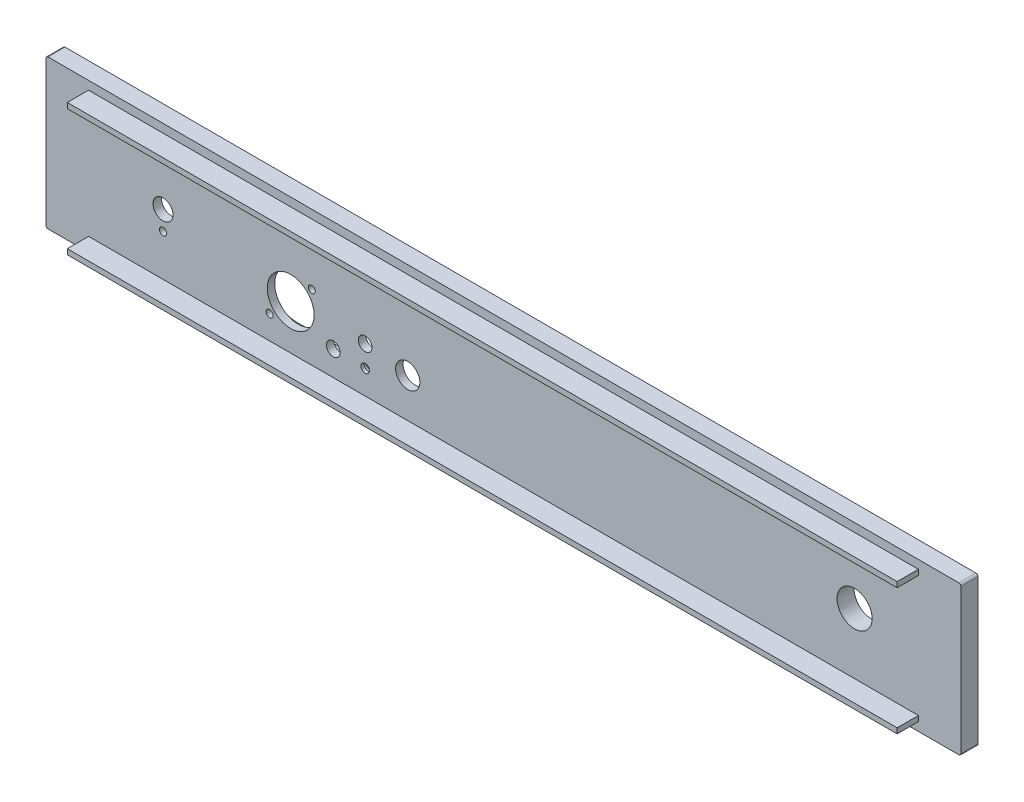
ISO-10303-21;
HEADER;
FILE_DESCRIPTION(('STEP AP214'),'2;1');
FILE_NAME('part.step','',(''),(''),'','','');
FILE_SCHEMA(('AUTOMOTIVE_DESIGN { 1 0 10303 214 1 1 1 1 }'));
ENDSEC;
DATA;
#1=APPLICATION_CONTEXT('core data for automotive mechanical design processes');
#2=APPLICATION_PROTOCOL_DEFINITION('international standard','automotive_design',2000,#1);
#3=PRODUCT_CONTEXT('',#1,'mechanical');
#4=PRODUCT('Part','Part','',(#3));
#5=PRODUCT_RELATED_PRODUCT_CATEGORY('part','',(#4));
#6=PRODUCT_DEFINITION_FORMATION('','',#4);
#7=PRODUCT_DEFINITION_CONTEXT('part definition',#1,'design');
#8=PRODUCT_DEFINITION('design','',#6,#7);
#9=PRODUCT_DEFINITION_SHAPE('','',#8);
#10=(LENGTH_UNIT() NAMED_UNIT(*) SI_UNIT(.MILLI.,.METRE.));
#11=(NAMED_UNIT(*) PLANE_ANGLE_UNIT() SI_UNIT($,.RADIAN.));
#12=(NAMED_UNIT(*) SI_UNIT($,.STERADIAN.) SOLID_ANGLE_UNIT());
#13=UNCERTAINTY_MEASURE_WITH_UNIT(LENGTH_MEASURE(1.E-05),#10,'distance_accuracy_value','');
#14=(GEOMETRIC_REPRESENTATION_CONTEXT(3) GLOBAL_UNCERTAINTY_ASSIGNED_CONTEXT((#13)) GLOBAL_UNIT_ASSIGNED_CONTEXT((#10,
#11,#12)) REPRESENTATION_CONTEXT('',''));
#15=CARTESIAN_POINT('',(0.,0.,0.));
#16=DIRECTION('',(0.,0.,1.));
#17=DIRECTION('',(1.,0.,0.));
#18=AXIS2_PLACEMENT_3D('',#15,#16,#17);
#19=CARTESIAN_POINT('',(-160.,-9.00000000000001,18.));
#20=DIRECTION('',(0.,0.,-1.));
#21=DIRECTION('',(-1.,0.,0.));
#22=AXIS2_PLACEMENT_3D('',#19,#20,#21);
#23=CYLINDRICAL_SURFACE('',#22,1.70000000000001);
#24=CARTESIAN_POINT('',(-160.,-9.00000000000001,8.));
#25=DIRECTION('',(0.,0.,-1.));
#26=DIRECTION('',(-1.,0.,0.));
#27=AXIS2_PLACEMENT_3D('',#24,#25,#26);
#28=CIRCLE('',#27,1.70000000000001);
#29=CARTESIAN_POINT('',(-161.7,-9.00000000000001,8.));
#30=VERTEX_POINT('',#29);
#31=EDGE_CURVE('E251',#30,#30,#28,.T.);
#32=ORIENTED_EDGE('',*,*,#31,.F.);
#33=EDGE_LOOP('',(#32));
#34=FACE_BOUND('',#33,.T.);
#35=CARTESIAN_POINT('',(-160.,-9.00000000000001,4.));
#36=DIRECTION('',(0.,0.,-1.));
#37=DIRECTION('',(-1.,0.,0.));
#38=AXIS2_PLACEMENT_3D('',#35,#36,#37);
#39=CIRCLE('',#38,1.70000000000001);
#40=CARTESIAN_POINT('',(-161.7,-9.00000000000001,4.));
#41=VERTEX_POINT('',#40);
#42=EDGE_CURVE('E404',#41,#41,#39,.F.);
#43=ORIENTED_EDGE('',*,*,#42,.F.);
#44=EDGE_LOOP('',(#43));
#45=FACE_BOUND('',#44,.T.);
#46=ADVANCED_FACE('F44',(#34,#45),#23,.F.);
#47=CARTESIAN_POINT('',(-160.,0.,18.));
#48=DIRECTION('',(0.,0.,-1.));
#49=DIRECTION('',(-1.,0.,0.));
#50=AXIS2_PLACEMENT_3D('',#47,#48,#49);
#51=CYLINDRICAL_SURFACE('',#50,4.70000000000001);
#52=CARTESIAN_POINT('',(-160.,0.,8.));
#53=DIRECTION('',(0.,0.,-1.));
#54=DIRECTION('',(-1.,0.,0.));
#55=AXIS2_PLACEMENT_3D('',#52,#53,#54);
#56=CIRCLE('',#55,4.70000000000001);
#57=CARTESIAN_POINT('',(-164.7,0.,8.));
#58=VERTEX_POINT('',#57);
#59=EDGE_CURVE('E248',#58,#58,#56,.T.);
#60=ORIENTED_EDGE('',*,*,#59,.F.);
#61=EDGE_LOOP('',(#60));
#62=FACE_BOUND('',#61,.T.);
#63=CARTESIAN_POINT('',(-160.,0.,4.));
#64=DIRECTION('',(0.,0.,-1.));
#65=DIRECTION('',(-1.,0.,0.));
#66=AXIS2_PLACEMENT_3D('',#63,#64,#65);
#67=CIRCLE('',#66,4.70000000000001);
#68=CARTESIAN_POINT('',(-164.7,0.,4.));
#69=VERTEX_POINT('',#68);
#70=EDGE_CURVE('E48',#69,#69,#67,.F.);
#71=ORIENTED_EDGE('',*,*,#70,.F.);
#72=EDGE_LOOP('',(#71));
#73=FACE_BOUND('',#72,.T.);
#74=ADVANCED_FACE('F419',(#62,#73),#51,.F.);
#75=CARTESIAN_POINT('',(-64.9999999999999,-17.2,18.));
#76=DIRECTION('',(0.,0.,-1.));
#77=DIRECTION('',(-1.,0.,0.));
#78=AXIS2_PLACEMENT_3D('',#75,#76,#77);
#79=CYLINDRICAL_SURFACE('',#78,2.);
#80=CARTESIAN_POINT('',(-64.9999999999999,-17.2,8.));
#81=DIRECTION('',(0.,0.,-1.));
#82=DIRECTION('',(-1.,0.,0.));
#83=AXIS2_PLACEMENT_3D('',#80,#81,#82);
#84=CIRCLE('',#83,2.);
#85=CARTESIAN_POINT('',(-66.9999999999999,-17.2,8.));
#86=VERTEX_POINT('',#85);
#87=EDGE_CURVE('E245',#86,#86,#84,.T.);
#88=ORIENTED_EDGE('',*,*,#87,.F.);
#89=EDGE_LOOP('',(#88));
#90=FACE_BOUND('',#89,.T.);
#91=CARTESIAN_POINT('',(-64.9999999999999,-17.2,6.5));
#92=DIRECTION('',(0.,0.,-1.));
#93=DIRECTION('',(-1.,0.,0.));
#94=AXIS2_PLACEMENT_3D('',#91,#92,#93);
#95=CIRCLE('',#94,2.);
#96=CARTESIAN_POINT('',(-66.9999999999999,-17.2,6.5));
#97=VERTEX_POINT('',#96);
#98=EDGE_CURVE('E217',#97,#97,#95,.F.);
#99=ORIENTED_EDGE('',*,*,#98,.F.);
#100=EDGE_LOOP('',(#99));
#101=FACE_BOUND('',#100,.T.);
#102=ADVANCED_FACE('F421',(#90,#101),#79,.F.);
#103=CARTESIAN_POINT('',(-90.0999999999999,2.39999999999999,18.));
#104=DIRECTION('',(0.,0.,-1.));
#105=DIRECTION('',(-1.,0.,0.));
#106=AXIS2_PLACEMENT_3D('',#103,#104,#105);
#107=CYLINDRICAL_SURFACE('',#106,1.65000000000002);
#108=CARTESIAN_POINT('',(-90.0999999999999,2.39999999999999,8.));
#109=DIRECTION('',(0.,0.,-1.));
#110=DIRECTION('',(-1.,0.,0.));
#111=AXIS2_PLACEMENT_3D('',#108,#109,#110);
#112=CIRCLE('',#111,1.65000000000002);
#113=CARTESIAN_POINT('',(-91.7499999999999,2.39999999999999,8.));
#114=VERTEX_POINT('',#113);
#115=EDGE_CURVE('E266',#114,#114,#112,.T.);
#116=ORIENTED_EDGE('',*,*,#115,.F.);
#117=EDGE_LOOP('',(#116));
#118=FACE_BOUND('',#117,.T.);
#119=CARTESIAN_POINT('',(-90.0999999999999,2.39999999999999,4.5));
#120=DIRECTION('',(0.,0.,-1.));
#121=DIRECTION('',(-1.,0.,0.));
#122=AXIS2_PLACEMENT_3D('',#119,#120,#121);
#123=CIRCLE('',#122,1.65000000000002);
#124=CARTESIAN_POINT('',(-91.7499999999999,2.39999999999999,4.5));
#125=VERTEX_POINT('',#124);
#126=EDGE_CURVE('E239',#125,#125,#123,.F.);
#127=ORIENTED_EDGE('',*,*,#126,.F.);
#128=EDGE_LOOP('',(#127));
#129=FACE_BOUND('',#128,.T.);
#130=ADVANCED_FACE('F428',(#118,#129),#107,.F.);
#131=CARTESIAN_POINT('',(-99.9999999999999,-7.50000000000001,18.));
#132=DIRECTION('',(0.,0.,-1.));
#133=DIRECTION('',(-1.,0.,0.));
#134=AXIS2_PLACEMENT_3D('',#131,#132,#133);
#135=CYLINDRICAL_SURFACE('',#134,11.);
#136=CARTESIAN_POINT('',(-99.9999999999999,-7.50000000000001,8.));
#137=DIRECTION('',(0.,0.,-1.));
#138=DIRECTION('',(-1.,0.,0.));
#139=AXIS2_PLACEMENT_3D('',#136,#137,#138);
#140=CIRCLE('',#139,11.);
#141=CARTESIAN_POINT('',(-111.,-7.50000000000001,8.));
#142=VERTEX_POINT('',#141);
#143=EDGE_CURVE('E263',#142,#142,#140,.T.);
#144=ORIENTED_EDGE('',*,*,#143,.F.);
#145=EDGE_LOOP('',(#144));
#146=FACE_BOUND('',#145,.T.);
#147=CARTESIAN_POINT('',(-99.9999999999999,-7.50000000000001,4.5));
#148=DIRECTION('',(0.,0.,-1.));
#149=DIRECTION('',(-1.,0.,0.));
#150=AXIS2_PLACEMENT_3D('',#147,#148,#149);
#151=CIRCLE('',#150,11.);
#152=CARTESIAN_POINT('',(-111.,-7.50000000000001,4.5));
#153=VERTEX_POINT('',#152);
#154=EDGE_CURVE('E236',#153,#153,#151,.F.);
#155=ORIENTED_EDGE('',*,*,#154,.F.);
#156=EDGE_LOOP('',(#155));
#157=FACE_BOUND('',#156,.T.);
#158=ADVANCED_FACE('F448',(#146,#157),#135,.F.);
#159=CARTESIAN_POINT('',(-109.9,-17.4,18.));
#160=DIRECTION('',(0.,0.,-1.));
#161=DIRECTION('',(-1.,0.,0.));
#162=AXIS2_PLACEMENT_3D('',#159,#160,#161);
#163=CYLINDRICAL_SURFACE('',#162,1.65000000000002);
#164=CARTESIAN_POINT('',(-109.9,-17.4,8.));
#165=DIRECTION('',(0.,0.,-1.));
#166=DIRECTION('',(-1.,0.,0.));
#167=AXIS2_PLACEMENT_3D('',#164,#165,#166);
#168=CIRCLE('',#167,1.65000000000002);
#169=CARTESIAN_POINT('',(-111.55,-17.4,8.));
#170=VERTEX_POINT('',#169);
#171=EDGE_CURVE('E260',#170,#170,#168,.T.);
#172=ORIENTED_EDGE('',*,*,#171,.F.);
#173=EDGE_LOOP('',(#172));
#174=FACE_BOUND('',#173,.T.);
#175=CARTESIAN_POINT('',(-109.9,-17.4,4.5));
#176=DIRECTION('',(0.,0.,-1.));
#177=DIRECTION('',(-1.,0.,0.));
#178=AXIS2_PLACEMENT_3D('',#175,#176,#177);
#179=CIRCLE('',#178,1.65000000000002);
#180=CARTESIAN_POINT('',(-111.55,-17.4,4.5));
#181=VERTEX_POINT('',#180);
#182=EDGE_CURVE('E233',#181,#181,#179,.F.);
#183=ORIENTED_EDGE('',*,*,#182,.F.);
#184=EDGE_LOOP('',(#183));
#185=FACE_BOUND('',#184,.T.);
#186=ADVANCED_FACE('F444',(#174,#185),#163,.F.);
#187=CARTESIAN_POINT('',(-79.9999999999999,-16.75,18.));
#188=DIRECTION('',(0.,0.,-1.));
#189=DIRECTION('',(-1.,0.,0.));
#190=AXIS2_PLACEMENT_3D('',#187,#188,#189);
#191=CYLINDRICAL_SURFACE('',#190,3.25000000000001);
#192=CARTESIAN_POINT('',(-79.9999999999999,-16.75,8.));
#193=DIRECTION('',(0.,0.,-1.));
#194=DIRECTION('',(-1.,0.,0.));
#195=AXIS2_PLACEMENT_3D('',#192,#193,#194);
#196=CIRCLE('',#195,3.25000000000001);
#197=CARTESIAN_POINT('',(-83.2499999999999,-16.75,8.));
#198=VERTEX_POINT('',#197);
#199=EDGE_CURVE('E257',#198,#198,#196,.T.);
#200=ORIENTED_EDGE('',*,*,#199,.F.);
#201=EDGE_LOOP('',(#200));
#202=FACE_BOUND('',#201,.T.);
#203=CARTESIAN_POINT('',(-79.9999999999999,-16.75,4.5));
#204=DIRECTION('',(0.,0.,-1.));
#205=DIRECTION('',(-1.,0.,0.));
#206=AXIS2_PLACEMENT_3D('',#203,#204,#205);
#207=CIRCLE('',#206,3.25000000000001);
#208=CARTESIAN_POINT('',(-83.2499999999999,-16.75,4.5));
#209=VERTEX_POINT('',#208);
#210=EDGE_CURVE('E230',#209,#209,#207,.F.);
#211=ORIENTED_EDGE('',*,*,#210,.F.);
#212=EDGE_LOOP('',(#211));
#213=FACE_BOUND('',#212,.T.);
#214=ADVANCED_FACE('F440',(#202,#213),#191,.F.);
#215=CARTESIAN_POINT('',(-44.9999999999999,-10.11,18.));
#216=DIRECTION('',(0.,0.,-1.));
#217=DIRECTION('',(-1.,0.,0.));
#218=AXIS2_PLACEMENT_3D('',#215,#216,#217);
#219=CYLINDRICAL_SURFACE('',#218,5.69999999999999);
#220=CARTESIAN_POINT('',(-44.9999999999999,-10.11,8.));
#221=DIRECTION('',(0.,0.,-1.));
#222=DIRECTION('',(-1.,0.,0.));
#223=AXIS2_PLACEMENT_3D('',#220,#221,#222);
#224=CIRCLE('',#223,5.69999999999999);
#225=CARTESIAN_POINT('',(-50.6999999999999,-10.11,8.));
#226=VERTEX_POINT('',#225);
#227=EDGE_CURVE('E254',#226,#226,#224,.T.);
#228=ORIENTED_EDGE('',*,*,#227,.F.);
#229=EDGE_LOOP('',(#228));
#230=FACE_BOUND('',#229,.T.);
#231=CARTESIAN_POINT('',(-44.9999999999999,-10.11,4.5));
#232=DIRECTION('',(0.,0.,-1.));
#233=DIRECTION('',(-1.,0.,0.));
#234=AXIS2_PLACEMENT_3D('',#231,#232,#233);
#235=CIRCLE('',#234,5.69999999999999);
#236=CARTESIAN_POINT('',(-50.6999999999999,-10.11,4.5));
#237=VERTEX_POINT('',#236);
#238=EDGE_CURVE('E227',#237,#237,#235,.F.);
#239=ORIENTED_EDGE('',*,*,#238,.F.);
#240=EDGE_LOOP('',(#239));
#241=FACE_BOUND('',#240,.T.);
#242=ADVANCED_FACE('F436',(#230,#241),#219,.F.);
#243=CARTESIAN_POINT('',(-64.9999999999999,-7.20000000000001,18.));
#244=DIRECTION('',(0.,0.,-1.));
#245=DIRECTION('',(-1.,0.,0.));
#246=AXIS2_PLACEMENT_3D('',#243,#244,#245);
#247=CYLINDRICAL_SURFACE('',#246,3.2);
#248=CARTESIAN_POINT('',(-64.9999999999999,-7.20000000000001,8.));
#249=DIRECTION('',(0.,0.,-1.));
#250=DIRECTION('',(-1.,0.,0.));
#251=AXIS2_PLACEMENT_3D('',#248,#249,#250);
#252=CIRCLE('',#251,3.2);
#253=CARTESIAN_POINT('',(-68.1999999999999,-7.20000000000001,8.));
#254=VERTEX_POINT('',#253);
#255=EDGE_CURVE('E242',#254,#254,#252,.T.);
#256=ORIENTED_EDGE('',*,*,#255,.F.);
#257=EDGE_LOOP('',(#256));
#258=FACE_BOUND('',#257,.T.);
#259=CARTESIAN_POINT('',(-64.9999999999999,-7.20000000000001,4.5));
#260=DIRECTION('',(0.,0.,-1.));
#261=DIRECTION('',(-1.,0.,0.));
#262=AXIS2_PLACEMENT_3D('',#259,#260,#261);
#263=CIRCLE('',#262,3.2);
#264=CARTESIAN_POINT('',(-68.1999999999999,-7.20000000000001,4.5));
#265=VERTEX_POINT('',#264);
#266=EDGE_CURVE('E223',#265,#265,#263,.F.);
#267=ORIENTED_EDGE('',*,*,#266,.F.);
#268=EDGE_LOOP('',(#267));
#269=FACE_BOUND('',#268,.T.);
#270=ADVANCED_FACE('F439',(#258,#269),#247,.F.);
#271=CARTESIAN_POINT('',(0.,0.,8.));
#272=DIRECTION('',(0.,0.,-1.));
#273=DIRECTION('',(-1.,0.,0.));
#274=AXIS2_PLACEMENT_3D('',#271,#272,#273);
#275=PLANE('',#274);
#276=CARTESIAN_POINT('',(165.,0.,8.));
#277=DIRECTION('',(0.,0.,-1.));
#278=DIRECTION('',(-1.,0.,0.));
#279=AXIS2_PLACEMENT_3D('',#276,#277,#278);
#280=CIRCLE('',#279,8.25);
#281=CARTESIAN_POINT('',(156.75,0.,8.));
#282=VERTEX_POINT('',#281);
#283=EDGE_CURVE('E397',#282,#282,#280,.T.);
#284=ORIENTED_EDGE('',*,*,#283,.T.);
#285=EDGE_LOOP('',(#284));
#286=FACE_BOUND('',#285,.T.);
#287=ORIENTED_EDGE('',*,*,#255,.T.);
#288=EDGE_LOOP('',(#287));
#289=FACE_BOUND('',#288,.T.);
#290=ORIENTED_EDGE('',*,*,#87,.T.);
#291=EDGE_LOOP('',(#290));
#292=FACE_BOUND('',#291,.T.);
#293=ORIENTED_EDGE('',*,*,#59,.T.);
#294=EDGE_LOOP('',(#293));
#295=FACE_BOUND('',#294,.T.);
#296=ORIENTED_EDGE('',*,*,#31,.T.);
#297=EDGE_LOOP('',(#296));
#298=FACE_BOUND('',#297,.T.);
#299=ORIENTED_EDGE('',*,*,#227,.T.);
#300=EDGE_LOOP('',(#299));
#301=FACE_BOUND('',#300,.T.);
#302=ORIENTED_EDGE('',*,*,#199,.T.);
#303=EDGE_LOOP('',(#302));
#304=FACE_BOUND('',#303,.T.);
#305=ORIENTED_EDGE('',*,*,#171,.T.);
#306=EDGE_LOOP('',(#305));
#307=FACE_BOUND('',#306,.T.);
#308=ORIENTED_EDGE('',*,*,#143,.T.);
#309=EDGE_LOOP('',(#308));
#310=FACE_BOUND('',#309,.T.);
#311=ORIENTED_EDGE('',*,*,#115,.T.);
#312=EDGE_LOOP('',(#311));
#313=FACE_BOUND('',#312,.T.);
#314=DIRECTION('',(0.,-1.,0.));
#315=VECTOR('',#314,1.);
#316=CARTESIAN_POINT('',(-195.,31.,8.));
#317=LINE('',#316,#315);
#318=CARTESIAN_POINT('',(-195.,31.,8.));
#319=VERTEX_POINT('',#318);
#320=CARTESIAN_POINT('',(-195.,28.5,8.));
#321=VERTEX_POINT('',#320);
#322=EDGE_CURVE('E299',#319,#321,#317,.T.);
#323=ORIENTED_EDGE('',*,*,#322,.F.);
#324=DIRECTION('',(-1.,0.,0.));
#325=VECTOR('',#324,1.);
#326=CARTESIAN_POINT('',(-195.,31.,8.));
#327=LINE('',#326,#325);
#328=CARTESIAN_POINT('',(195.,31.,8.));
#329=VERTEX_POINT('',#328);
#330=EDGE_CURVE('E304',#329,#319,#327,.T.);
#331=ORIENTED_EDGE('',*,*,#330,.F.);
#332=DIRECTION('',(0.,1.,0.));
#333=VECTOR('',#332,1.);
#334=CARTESIAN_POINT('',(195.,31.,8.));
#335=LINE('',#334,#333);
#336=CARTESIAN_POINT('',(195.,28.5,8.));
#337=VERTEX_POINT('',#336);
#338=EDGE_CURVE('E316',#337,#329,#335,.T.);
#339=ORIENTED_EDGE('',*,*,#338,.F.);
#340=DIRECTION('',(1.,0.,0.));
#341=VECTOR('',#340,1.);
#342=CARTESIAN_POINT('',(-195.,28.5,8.));
#343=LINE('',#342,#341);
#344=EDGE_CURVE('E313',#321,#337,#343,.T.);
#345=ORIENTED_EDGE('',*,*,#344,.F.);
#346=EDGE_LOOP('',(#323,#331,#339,#345));
#347=FACE_BOUND('',#346,.T.);
#348=DIRECTION('',(-1.,0.,0.));
#349=VECTOR('',#348,1.);
#350=CARTESIAN_POINT('',(-215.,35.,8.));
#351=LINE('',#350,#349);
#352=CARTESIAN_POINT('',(214.,35.,8.));
#353=VERTEX_POINT('',#352);
#354=CARTESIAN_POINT('',(-214.,35.,8.));
#355=VERTEX_POINT('',#354);
#356=EDGE_CURVE('E336',#353,#355,#351,.T.);
#357=ORIENTED_EDGE('',*,*,#356,.T.);
#358=CARTESIAN_POINT('',(-214.,34.,8.));
#359=DIRECTION('',(0.,0.,-1.));
#360=DIRECTION('',(-1.,0.,0.));
#361=AXIS2_PLACEMENT_3D('',#358,#359,#360);
#362=CIRCLE('',#361,1.);
#363=CARTESIAN_POINT('',(-215.,34.,8.));
#364=VERTEX_POINT('',#363);
#365=EDGE_CURVE('E380',#355,#364,#362,.F.);
#366=ORIENTED_EDGE('',*,*,#365,.T.);
#367=DIRECTION('',(0.,-1.,0.));
#368=VECTOR('',#367,1.);
#369=CARTESIAN_POINT('',(-215.,-35.,8.));
#370=LINE('',#369,#368);
#371=CARTESIAN_POINT('',(-215.,-34.,8.));
#372=VERTEX_POINT('',#371);
#373=EDGE_CURVE('E340',#364,#372,#370,.T.);
#374=ORIENTED_EDGE('',*,*,#373,.T.);
#375=CARTESIAN_POINT('',(-214.,-34.,8.));
#376=DIRECTION('',(0.,0.,-1.));
#377=DIRECTION('',(-1.,0.,0.));
#378=AXIS2_PLACEMENT_3D('',#375,#376,#377);
#379=CIRCLE('',#378,1.);
#380=CARTESIAN_POINT('',(-214.,-35.,8.));
#381=VERTEX_POINT('',#380);
#382=EDGE_CURVE('E378',#372,#381,#379,.F.);
#383=ORIENTED_EDGE('',*,*,#382,.T.);
#384=DIRECTION('',(1.,0.,0.));
#385=VECTOR('',#384,1.);
#386=CARTESIAN_POINT('',(-215.,-35.,8.));
#387=LINE('',#386,#385);
#388=CARTESIAN_POINT('',(214.,-35.,8.));
#389=VERTEX_POINT('',#388);
#390=EDGE_CURVE('E343',#381,#389,#387,.T.);
#391=ORIENTED_EDGE('',*,*,#390,.T.);
#392=CARTESIAN_POINT('',(214.,-34.,8.));
#393=DIRECTION('',(0.,0.,-1.));
#394=DIRECTION('',(-1.,0.,0.));
#395=AXIS2_PLACEMENT_3D('',#392,#393,#394);
#396=CIRCLE('',#395,1.);
#397=CARTESIAN_POINT('',(215.,-34.,8.));
#398=VERTEX_POINT('',#397);
#399=EDGE_CURVE('E376',#389,#398,#396,.F.);
#400=ORIENTED_EDGE('',*,*,#399,.T.);
#401=DIRECTION('',(0.,1.,0.));
#402=VECTOR('',#401,1.);
#403=CARTESIAN_POINT('',(215.,-35.,8.));
#404=LINE('',#403,#402);
#405=CARTESIAN_POINT('',(215.,34.,8.));
#406=VERTEX_POINT('',#405);
#407=EDGE_CURVE('E333',#398,#406,#404,.T.);
#408=ORIENTED_EDGE('',*,*,#407,.T.);
#409=CARTESIAN_POINT('',(214.,34.,8.));
#410=DIRECTION('',(0.,0.,-1.));
#411=DIRECTION('',(-1.,0.,0.));
#412=AXIS2_PLACEMENT_3D('',#409,#410,#411);
#413=CIRCLE('',#412,1.);
#414=EDGE_CURVE('E374',#406,#353,#413,.F.);
#415=ORIENTED_EDGE('',*,*,#414,.T.);
#416=EDGE_LOOP('',(#357,#366,#374,#383,#391,#400,#408,#415));
#417=FACE_BOUND('',#416,.T.);
#418=DIRECTION('',(0.,1.,0.));
#419=VECTOR('',#418,1.);
#420=CARTESIAN_POINT('',(195.,-28.5,8.));
#421=LINE('',#420,#419);
#422=CARTESIAN_POINT('',(195.,-31.,8.));
#423=VERTEX_POINT('',#422);
#424=CARTESIAN_POINT('',(195.,-28.5,8.));
#425=VERTEX_POINT('',#424);
#426=EDGE_CURVE('E269',#423,#425,#421,.T.);
#427=ORIENTED_EDGE('',*,*,#426,.F.);
#428=DIRECTION('',(1.,0.,0.));
#429=VECTOR('',#428,1.);
#430=CARTESIAN_POINT('',(195.,-31.,8.));
#431=LINE('',#430,#429);
#432=CARTESIAN_POINT('',(-195.,-31.,8.));
#433=VERTEX_POINT('',#432);
#434=EDGE_CURVE('E274',#433,#423,#431,.T.);
#435=ORIENTED_EDGE('',*,*,#434,.F.);
#436=DIRECTION('',(0.,-1.,0.));
#437=VECTOR('',#436,1.);
#438=CARTESIAN_POINT('',(-195.,-28.5,8.));
#439=LINE('',#438,#437);
#440=CARTESIAN_POINT('',(-195.,-28.5,8.));
#441=VERTEX_POINT('',#440);
#442=EDGE_CURVE('E284',#441,#433,#439,.T.);
#443=ORIENTED_EDGE('',*,*,#442,.F.);
#444=DIRECTION('',(-1.,0.,0.));
#445=VECTOR('',#444,1.);
#446=CARTESIAN_POINT('',(195.,-28.5,8.));
#447=LINE('',#446,#445);
#448=EDGE_CURVE('E69',#425,#441,#447,.T.);
#449=ORIENTED_EDGE('',*,*,#448,.F.);
#450=EDGE_LOOP('',(#427,#435,#443,#449));
#451=FACE_BOUND('',#450,.T.);
#452=ADVANCED_FACE('F496',(#286,#289,#292,#295,#298,#301,#304,#307,#310,#313,#347,#417,#451),
#275,.F.);
#453=CARTESIAN_POINT('',(215.,-35.,8.));
#454=DIRECTION('',(-1.,0.,0.));
#455=DIRECTION('',(0.,0.,1.));
#456=AXIS2_PLACEMENT_3D('',#453,#454,#455);
#457=PLANE('',#456);
#458=ORIENTED_EDGE('',*,*,#407,.F.);
#459=DIRECTION('',(0.,0.,-1.));
#460=VECTOR('',#459,1.);
#461=CARTESIAN_POINT('',(215.,-34.,8.));
#462=LINE('',#461,#460);
#463=CARTESIAN_POINT('',(215.,-34.,0.));
#464=VERTEX_POINT('',#463);
#465=EDGE_CURVE('E12',#398,#464,#462,.T.);
#466=ORIENTED_EDGE('',*,*,#465,.T.);
#467=DIRECTION('',(0.,1.,0.));
#468=VECTOR('',#467,1.);
#469=CARTESIAN_POINT('',(215.,-35.,0.));
#470=LINE('',#469,#468);
#471=CARTESIAN_POINT('',(215.,34.,0.));
#472=VERTEX_POINT('',#471);
#473=EDGE_CURVE('E332',#464,#472,#470,.T.);
#474=ORIENTED_EDGE('',*,*,#473,.T.);
#475=DIRECTION('',(0.,0.,-1.));
#476=VECTOR('',#475,1.);
#477=CARTESIAN_POINT('',(215.,34.,8.));
#478=LINE('',#477,#476);
#479=EDGE_CURVE('E53',#472,#406,#478,.F.);
#480=ORIENTED_EDGE('',*,*,#479,.T.);
#481=EDGE_LOOP('',(#458,#466,#474,#480));
#482=FACE_BOUND('',#481,.T.);
#483=ADVANCED_FACE('F499',(#482),#457,.F.);
#484=CARTESIAN_POINT('',(-215.,35.,8.));
#485=DIRECTION('',(0.,-1.,0.));
#486=DIRECTION('',(0.,0.,-1.));
#487=AXIS2_PLACEMENT_3D('',#484,#485,#486);
#488=PLANE('',#487);
#489=DIRECTION('',(-1.,0.,0.));
#490=VECTOR('',#489,1.);
#491=CARTESIAN_POINT('',(-215.,35.,0.));
#492=LINE('',#491,#490);
#493=CARTESIAN_POINT('',(214.,35.,0.));
#494=VERTEX_POINT('',#493);
#495=CARTESIAN_POINT('',(-214.,35.,0.));
#496=VERTEX_POINT('',#495);
#497=EDGE_CURVE('E349',#494,#496,#492,.T.);
#498=ORIENTED_EDGE('',*,*,#497,.T.);
#499=DIRECTION('',(0.,0.,-1.));
#500=VECTOR('',#499,1.);
#501=CARTESIAN_POINT('',(-214.,35.,8.));
#502=LINE('',#501,#500);
#503=EDGE_CURVE('E372',#496,#355,#502,.F.);
#504=ORIENTED_EDGE('',*,*,#503,.T.);
#505=ORIENTED_EDGE('',*,*,#356,.F.);
#506=DIRECTION('',(0.,0.,-1.));
#507=VECTOR('',#506,1.);
#508=CARTESIAN_POINT('',(214.,35.,8.));
#509=LINE('',#508,#507);
#510=EDGE_CURVE('E369',#353,#494,#509,.T.);
#511=ORIENTED_EDGE('',*,*,#510,.T.);
#512=EDGE_LOOP('',(#498,#504,#505,#511));
#513=FACE_BOUND('',#512,.T.);
#514=ADVANCED_FACE('F513',(#513),#488,.F.);
#515=CARTESIAN_POINT('',(-215.,-35.,8.));
#516=DIRECTION('',(1.,0.,0.));
#517=DIRECTION('',(0.,0.,-1.));
#518=AXIS2_PLACEMENT_3D('',#515,#516,#517);
#519=PLANE('',#518);
#520=ORIENTED_EDGE('',*,*,#373,.F.);
#521=DIRECTION('',(0.,0.,-1.));
#522=VECTOR('',#521,1.);
#523=CARTESIAN_POINT('',(-215.,34.,8.));
#524=LINE('',#523,#522);
#525=CARTESIAN_POINT('',(-215.,34.,0.));
#526=VERTEX_POINT('',#525);
#527=EDGE_CURVE('E358',#364,#526,#524,.T.);
#528=ORIENTED_EDGE('',*,*,#527,.T.);
#529=DIRECTION('',(0.,-1.,0.));
#530=VECTOR('',#529,1.);
#531=CARTESIAN_POINT('',(-215.,-35.,0.));
#532=LINE('',#531,#530);
#533=CARTESIAN_POINT('',(-215.,-34.,0.));
#534=VERTEX_POINT('',#533);
#535=EDGE_CURVE('E352',#526,#534,#532,.T.);
#536=ORIENTED_EDGE('',*,*,#535,.T.);
#537=DIRECTION('',(0.,0.,-1.));
#538=VECTOR('',#537,1.);
#539=CARTESIAN_POINT('',(-215.,-34.,8.));
#540=LINE('',#539,#538);
#541=EDGE_CURVE('E346',#534,#372,#540,.F.);
#542=ORIENTED_EDGE('',*,*,#541,.T.);
#543=EDGE_LOOP('',(#520,#528,#536,#542));
#544=FACE_BOUND('',#543,.T.);
#545=ADVANCED_FACE('F509',(#544),#519,.F.);
#546=CARTESIAN_POINT('',(-215.,-35.,8.));
#547=DIRECTION('',(0.,1.,0.));
#548=DIRECTION('',(0.,0.,1.));
#549=AXIS2_PLACEMENT_3D('',#546,#547,#548);
#550=PLANE('',#549);
#551=ORIENTED_EDGE('',*,*,#390,.F.);
#552=DIRECTION('',(0.,0.,-1.));
#553=VECTOR('',#552,1.);
#554=CARTESIAN_POINT('',(-214.,-35.,8.));
#555=LINE('',#554,#553);
#556=CARTESIAN_POINT('',(-214.,-35.,0.));
#557=VERTEX_POINT('',#556);
#558=EDGE_CURVE('E384',#381,#557,#555,.T.);
#559=ORIENTED_EDGE('',*,*,#558,.T.);
#560=DIRECTION('',(1.,0.,0.));
#561=VECTOR('',#560,1.);
#562=CARTESIAN_POINT('',(-215.,-35.,0.));
#563=LINE('',#562,#561);
#564=CARTESIAN_POINT('',(214.,-35.,0.));
#565=VERTEX_POINT('',#564);
#566=EDGE_CURVE('E337',#557,#565,#563,.T.);
#567=ORIENTED_EDGE('',*,*,#566,.T.);
#568=DIRECTION('',(0.,0.,-1.));
#569=VECTOR('',#568,1.);
#570=CARTESIAN_POINT('',(214.,-35.,8.));
#571=LINE('',#570,#569);
#572=EDGE_CURVE('E382',#565,#389,#571,.F.);
#573=ORIENTED_EDGE('',*,*,#572,.T.);
#574=EDGE_LOOP('',(#551,#559,#567,#573));
#575=FACE_BOUND('',#574,.T.);
#576=ADVANCED_FACE('F505',(#575),#550,.F.);
#577=CARTESIAN_POINT('',(0.,0.,0.));
#578=DIRECTION('',(0.,0.,-1.));
#579=DIRECTION('',(-1.,0.,0.));
#580=AXIS2_PLACEMENT_3D('',#577,#578,#579);
#581=PLANE('',#580);
#582=CARTESIAN_POINT('',(-160.,0.60944620444614,0.));
#583=DIRECTION('',(0.,0.,-1.));
#584=DIRECTION('',(-1.,0.,0.));
#585=AXIS2_PLACEMENT_3D('',#582,#583,#584);
#586=CIRCLE('',#585,20.);
#587=CARTESIAN_POINT('',(-180.,0.60944620444614,0.));
#588=VERTEX_POINT('',#587);
#589=EDGE_CURVE('E407',#588,#588,#586,.T.);
#590=ORIENTED_EDGE('',*,*,#589,.F.);
#591=EDGE_LOOP('',(#590));
#592=FACE_BOUND('',#591,.T.);
#593=CARTESIAN_POINT('',(165.,0.,0.));
#594=DIRECTION('',(0.,0.,-1.));
#595=DIRECTION('',(-1.,0.,0.));
#596=AXIS2_PLACEMENT_3D('',#593,#594,#595);
#597=CIRCLE('',#596,8.25);
#598=CARTESIAN_POINT('',(156.75,0.,0.));
#599=VERTEX_POINT('',#598);
#600=EDGE_CURVE('E401',#599,#599,#597,.T.);
#601=ORIENTED_EDGE('',*,*,#600,.F.);
#602=EDGE_LOOP('',(#601));
#603=FACE_BOUND('',#602,.T.);
#604=CARTESIAN_POINT('',(-44.9999999999999,-7.5,0.));
#605=DIRECTION('',(0.,0.,-1.));
#606=DIRECTION('',(-1.,0.,0.));
#607=AXIS2_PLACEMENT_3D('',#604,#605,#606);
#608=CIRCLE('',#607,15.);
#609=CARTESIAN_POINT('',(-44.9999999999999,7.5,0.));
#610=VERTEX_POINT('',#609);
#611=CARTESIAN_POINT('',(-44.9999999999999,-22.5,0.));
#612=VERTEX_POINT('',#611);
#613=EDGE_CURVE('E61',#610,#612,#608,.T.);
#614=ORIENTED_EDGE('',*,*,#613,.F.);
#615=DIRECTION('',(1.,0.,0.));
#616=VECTOR('',#615,1.);
#617=CARTESIAN_POINT('',(-44.9999999999999,7.5,0.));
#618=LINE('',#617,#616);
#619=CARTESIAN_POINT('',(-105.,7.50000000000001,0.));
#620=VERTEX_POINT('',#619);
#621=EDGE_CURVE('E204',#620,#610,#618,.T.);
#622=ORIENTED_EDGE('',*,*,#621,.F.);
#623=CARTESIAN_POINT('',(-105.,-7.49999999999999,0.));
#624=DIRECTION('',(0.,0.,-1.));
#625=DIRECTION('',(-1.,0.,0.));
#626=AXIS2_PLACEMENT_3D('',#623,#624,#625);
#627=CIRCLE('',#626,15.);
#628=CARTESIAN_POINT('',(-105.,-22.5,0.));
#629=VERTEX_POINT('',#628);
#630=EDGE_CURVE('E207',#629,#620,#627,.T.);
#631=ORIENTED_EDGE('',*,*,#630,.F.);
#632=DIRECTION('',(-1.,0.,0.));
#633=VECTOR('',#632,1.);
#634=CARTESIAN_POINT('',(-44.9999999999999,-22.5,0.));
#635=LINE('',#634,#633);
#636=EDGE_CURVE('E216',#612,#629,#635,.T.);
#637=ORIENTED_EDGE('',*,*,#636,.F.);
#638=EDGE_LOOP('',(#614,#622,#631,#637));
#639=FACE_BOUND('',#638,.T.);
#640=ORIENTED_EDGE('',*,*,#535,.F.);
#641=CARTESIAN_POINT('',(-214.,34.,0.));
#642=DIRECTION('',(0.,0.,-1.));
#643=DIRECTION('',(-1.,0.,0.));
#644=AXIS2_PLACEMENT_3D('',#641,#642,#643);
#645=CIRCLE('',#644,1.);
#646=EDGE_CURVE('E367',#526,#496,#645,.T.);
#647=ORIENTED_EDGE('',*,*,#646,.T.);
#648=ORIENTED_EDGE('',*,*,#497,.F.);
#649=CARTESIAN_POINT('',(214.,34.,0.));
#650=DIRECTION('',(0.,0.,-1.));
#651=DIRECTION('',(-1.,0.,0.));
#652=AXIS2_PLACEMENT_3D('',#649,#650,#651);
#653=CIRCLE('',#652,1.);
#654=EDGE_CURVE('E361',#494,#472,#653,.T.);
#655=ORIENTED_EDGE('',*,*,#654,.T.);
#656=ORIENTED_EDGE('',*,*,#473,.F.);
#657=CARTESIAN_POINT('',(214.,-34.,0.));
#658=DIRECTION('',(0.,0.,-1.));
#659=DIRECTION('',(-1.,0.,0.));
#660=AXIS2_PLACEMENT_3D('',#657,#658,#659);
#661=CIRCLE('',#660,1.);
#662=EDGE_CURVE('E363',#464,#565,#661,.T.);
#663=ORIENTED_EDGE('',*,*,#662,.T.);
#664=ORIENTED_EDGE('',*,*,#566,.F.);
#665=CARTESIAN_POINT('',(-214.,-34.,0.));
#666=DIRECTION('',(0.,0.,-1.));
#667=DIRECTION('',(-1.,0.,0.));
#668=AXIS2_PLACEMENT_3D('',#665,#666,#667);
#669=CIRCLE('',#668,1.);
#670=EDGE_CURVE('E365',#557,#534,#669,.T.);
#671=ORIENTED_EDGE('',*,*,#670,.T.);
#672=EDGE_LOOP('',(#640,#647,#648,#655,#656,#663,#664,#671));
#673=FACE_BOUND('',#672,.T.);
#674=ADVANCED_FACE('F501',(#592,#603,#639,#673),#581,.T.);
#675=CARTESIAN_POINT('',(-214.,34.,8.));
#676=DIRECTION('',(0.,0.,-1.));
#677=DIRECTION('',(-1.,0.,0.));
#678=AXIS2_PLACEMENT_3D('',#675,#676,#677);
#679=CYLINDRICAL_SURFACE('',#678,1.);
#680=ORIENTED_EDGE('',*,*,#365,.F.);
#681=ORIENTED_EDGE('',*,*,#503,.F.);
#682=ORIENTED_EDGE('',*,*,#646,.F.);
#683=ORIENTED_EDGE('',*,*,#527,.F.);
#684=EDGE_LOOP('',(#680,#681,#682,#683));
#685=FACE_BOUND('',#684,.T.);
#686=ADVANCED_FACE('F504',(#685),#679,.T.);
#687=CARTESIAN_POINT('',(-214.,-34.,8.));
#688=DIRECTION('',(0.,0.,-1.));
#689=DIRECTION('',(-1.,0.,0.));
#690=AXIS2_PLACEMENT_3D('',#687,#688,#689);
#691=CYLINDRICAL_SURFACE('',#690,1.);
#692=ORIENTED_EDGE('',*,*,#382,.F.);
#693=ORIENTED_EDGE('',*,*,#541,.F.);
#694=ORIENTED_EDGE('',*,*,#670,.F.);
#695=ORIENTED_EDGE('',*,*,#558,.F.);
#696=EDGE_LOOP('',(#692,#693,#694,#695));
#697=FACE_BOUND('',#696,.T.);
#698=ADVANCED_FACE('F523',(#697),#691,.T.);
#699=CARTESIAN_POINT('',(214.,-34.,8.));
#700=DIRECTION('',(0.,0.,-1.));
#701=DIRECTION('',(-1.,0.,0.));
#702=AXIS2_PLACEMENT_3D('',#699,#700,#701);
#703=CYLINDRICAL_SURFACE('',#702,1.);
#704=ORIENTED_EDGE('',*,*,#399,.F.);
#705=ORIENTED_EDGE('',*,*,#572,.F.);
#706=ORIENTED_EDGE('',*,*,#662,.F.);
#707=ORIENTED_EDGE('',*,*,#465,.F.);
#708=EDGE_LOOP('',(#704,#705,#706,#707));
#709=FACE_BOUND('',#708,.T.);
#710=ADVANCED_FACE('F526',(#709),#703,.T.);
#711=CARTESIAN_POINT('',(214.,34.,8.));
#712=DIRECTION('',(0.,0.,-1.));
#713=DIRECTION('',(-1.,0.,0.));
#714=AXIS2_PLACEMENT_3D('',#711,#712,#713);
#715=CYLINDRICAL_SURFACE('',#714,1.);
#716=ORIENTED_EDGE('',*,*,#414,.F.);
#717=ORIENTED_EDGE('',*,*,#479,.F.);
#718=ORIENTED_EDGE('',*,*,#654,.F.);
#719=ORIENTED_EDGE('',*,*,#510,.F.);
#720=EDGE_LOOP('',(#716,#717,#718,#719));
#721=FACE_BOUND('',#720,.T.);
#722=ADVANCED_FACE('F46',(#721),#715,.T.);
#723=CARTESIAN_POINT('',(-195.,31.,18.));
#724=DIRECTION('',(1.,0.,0.));
#725=DIRECTION('',(0.,0.,-1.));
#726=AXIS2_PLACEMENT_3D('',#723,#724,#725);
#727=PLANE('',#726);
#728=ORIENTED_EDGE('',*,*,#322,.T.);
#729=DIRECTION('',(0.,0.,-1.));
#730=VECTOR('',#729,1.);
#731=CARTESIAN_POINT('',(-195.,28.5,18.));
#732=LINE('',#731,#730);
#733=CARTESIAN_POINT('',(-195.,28.5,18.));
#734=VERTEX_POINT('',#733);
#735=EDGE_CURVE('E329',#734,#321,#732,.T.);
#736=ORIENTED_EDGE('',*,*,#735,.F.);
#737=DIRECTION('',(0.,-1.,0.));
#738=VECTOR('',#737,1.);
#739=CARTESIAN_POINT('',(-195.,31.,18.));
#740=LINE('',#739,#738);
#741=CARTESIAN_POINT('',(-195.,31.,18.));
#742=VERTEX_POINT('',#741);
#743=EDGE_CURVE('E300',#742,#734,#740,.T.);
#744=ORIENTED_EDGE('',*,*,#743,.F.);
#745=DIRECTION('',(0.,0.,-1.));
#746=VECTOR('',#745,1.);
#747=CARTESIAN_POINT('',(-195.,31.,18.));
#748=LINE('',#747,#746);
#749=EDGE_CURVE('E310',#742,#319,#748,.T.);
#750=ORIENTED_EDGE('',*,*,#749,.T.);
#751=EDGE_LOOP('',(#728,#736,#744,#750));
#752=FACE_BOUND('',#751,.T.);
#753=ADVANCED_FACE('F491',(#752),#727,.F.);
#754=CARTESIAN_POINT('',(-195.,28.5,18.));
#755=DIRECTION('',(0.,1.,0.));
#756=DIRECTION('',(0.,0.,1.));
#757=AXIS2_PLACEMENT_3D('',#754,#755,#756);
#758=PLANE('',#757);
#759=ORIENTED_EDGE('',*,*,#344,.T.);
#760=DIRECTION('',(0.,0.,-1.));
#761=VECTOR('',#760,1.);
#762=CARTESIAN_POINT('',(195.,28.5,18.));
#763=LINE('',#762,#761);
#764=CARTESIAN_POINT('',(195.,28.5,18.));
#765=VERTEX_POINT('',#764);
#766=EDGE_CURVE('E326',#765,#337,#763,.T.);
#767=ORIENTED_EDGE('',*,*,#766,.F.);
#768=DIRECTION('',(1.,0.,0.));
#769=VECTOR('',#768,1.);
#770=CARTESIAN_POINT('',(-195.,28.5,18.));
#771=LINE('',#770,#769);
#772=EDGE_CURVE('E303',#734,#765,#771,.T.);
#773=ORIENTED_EDGE('',*,*,#772,.F.);
#774=ORIENTED_EDGE('',*,*,#735,.T.);
#775=EDGE_LOOP('',(#759,#767,#773,#774));
#776=FACE_BOUND('',#775,.T.);
#777=ADVANCED_FACE('F487',(#776),#758,.F.);
#778=CARTESIAN_POINT('',(195.,31.,18.));
#779=DIRECTION('',(-1.,0.,0.));
#780=DIRECTION('',(0.,0.,1.));
#781=AXIS2_PLACEMENT_3D('',#778,#779,#780);
#782=PLANE('',#781);
#783=ORIENTED_EDGE('',*,*,#338,.T.);
#784=DIRECTION('',(0.,0.,-1.));
#785=VECTOR('',#784,1.);
#786=CARTESIAN_POINT('',(195.,31.,18.));
#787=LINE('',#786,#785);
#788=CARTESIAN_POINT('',(195.,31.,18.));
#789=VERTEX_POINT('',#788);
#790=EDGE_CURVE('E323',#789,#329,#787,.T.);
#791=ORIENTED_EDGE('',*,*,#790,.F.);
#792=DIRECTION('',(0.,1.,0.));
#793=VECTOR('',#792,1.);
#794=CARTESIAN_POINT('',(195.,31.,18.));
#795=LINE('',#794,#793);
#796=EDGE_CURVE('E306',#765,#789,#795,.T.);
#797=ORIENTED_EDGE('',*,*,#796,.F.);
#798=ORIENTED_EDGE('',*,*,#766,.T.);
#799=EDGE_LOOP('',(#783,#791,#797,#798));
#800=FACE_BOUND('',#799,.T.);
#801=ADVANCED_FACE('F483',(#800),#782,.F.);
#802=CARTESIAN_POINT('',(-195.,31.,18.));
#803=DIRECTION('',(0.,-1.,0.));
#804=DIRECTION('',(0.,0.,-1.));
#805=AXIS2_PLACEMENT_3D('',#802,#803,#804);
#806=PLANE('',#805);
#807=ORIENTED_EDGE('',*,*,#330,.T.);
#808=ORIENTED_EDGE('',*,*,#749,.F.);
#809=DIRECTION('',(-1.,0.,0.));
#810=VECTOR('',#809,1.);
#811=CARTESIAN_POINT('',(-195.,31.,18.));
#812=LINE('',#811,#810);
#813=EDGE_CURVE('E308',#789,#742,#812,.T.);
#814=ORIENTED_EDGE('',*,*,#813,.F.);
#815=ORIENTED_EDGE('',*,*,#790,.T.);
#816=EDGE_LOOP('',(#807,#808,#814,#815));
#817=FACE_BOUND('',#816,.T.);
#818=ADVANCED_FACE('F479',(#817),#806,.F.);
#819=CARTESIAN_POINT('',(0.,0.,18.));
#820=DIRECTION('',(0.,0.,1.));
#821=DIRECTION('',(1.,0.,0.));
#822=AXIS2_PLACEMENT_3D('',#819,#820,#821);
#823=PLANE('',#822);
#824=ORIENTED_EDGE('',*,*,#743,.T.);
#825=ORIENTED_EDGE('',*,*,#772,.T.);
#826=ORIENTED_EDGE('',*,*,#796,.T.);
#827=ORIENTED_EDGE('',*,*,#813,.T.);
#828=EDGE_LOOP('',(#824,#825,#826,#827));
#829=FACE_BOUND('',#828,.T.);
#830=ADVANCED_FACE('F475',(#829),#823,.T.);
#831=CARTESIAN_POINT('',(195.,-28.5,18.));
#832=DIRECTION('',(-1.,0.,0.));
#833=DIRECTION('',(0.,0.,1.));
#834=AXIS2_PLACEMENT_3D('',#831,#832,#833);
#835=PLANE('',#834);
#836=ORIENTED_EDGE('',*,*,#426,.T.);
#837=DIRECTION('',(0.,0.,-1.));
#838=VECTOR('',#837,1.);
#839=CARTESIAN_POINT('',(195.,-28.5,18.));
#840=LINE('',#839,#838);
#841=CARTESIAN_POINT('',(195.,-28.5,18.));
#842=VERTEX_POINT('',#841);
#843=EDGE_CURVE('E297',#842,#425,#840,.T.);
#844=ORIENTED_EDGE('',*,*,#843,.F.);
#845=DIRECTION('',(0.,1.,0.));
#846=VECTOR('',#845,1.);
#847=CARTESIAN_POINT('',(195.,-28.5,18.));
#848=LINE('',#847,#846);
#849=CARTESIAN_POINT('',(195.,-31.,18.));
#850=VERTEX_POINT('',#849);
#851=EDGE_CURVE('E270',#850,#842,#848,.T.);
#852=ORIENTED_EDGE('',*,*,#851,.F.);
#853=DIRECTION('',(0.,0.,-1.));
#854=VECTOR('',#853,1.);
#855=CARTESIAN_POINT('',(195.,-31.,18.));
#856=LINE('',#855,#854);
#857=EDGE_CURVE('E280',#850,#423,#856,.T.);
#858=ORIENTED_EDGE('',*,*,#857,.T.);
#859=EDGE_LOOP('',(#836,#844,#852,#858));
#860=FACE_BOUND('',#859,.T.);
#861=ADVANCED_FACE('F471',(#860),#835,.F.);
#862=CARTESIAN_POINT('',(195.,-28.5,18.));
#863=DIRECTION('',(0.,-1.,0.));
#864=DIRECTION('',(1.,0.,0.));
#865=AXIS2_PLACEMENT_3D('',#862,#863,#864);
#866=PLANE('',#865);
#867=ORIENTED_EDGE('',*,*,#448,.T.);
#868=DIRECTION('',(0.,0.,-1.));
#869=VECTOR('',#868,1.);
#870=CARTESIAN_POINT('',(-195.,-28.5,18.));
#871=LINE('',#870,#869);
#872=CARTESIAN_POINT('',(-195.,-28.5,18.));
#873=VERTEX_POINT('',#872);
#874=EDGE_CURVE('E294',#873,#441,#871,.T.);
#875=ORIENTED_EDGE('',*,*,#874,.F.);
#876=DIRECTION('',(-1.,0.,0.));
#877=VECTOR('',#876,1.);
#878=CARTESIAN_POINT('',(195.,-28.5,18.));
#879=LINE('',#878,#877);
#880=EDGE_CURVE('E273',#842,#873,#879,.T.);
#881=ORIENTED_EDGE('',*,*,#880,.F.);
#882=ORIENTED_EDGE('',*,*,#843,.T.);
#883=EDGE_LOOP('',(#867,#875,#881,#882));
#884=FACE_BOUND('',#883,.T.);
#885=ADVANCED_FACE('F467',(#884),#866,.F.);
#886=CARTESIAN_POINT('',(-195.,-28.5,18.));
#887=DIRECTION('',(1.,0.,0.));
#888=DIRECTION('',(0.,0.,-1.));
#889=AXIS2_PLACEMENT_3D('',#886,#887,#888);
#890=PLANE('',#889);
#891=ORIENTED_EDGE('',*,*,#442,.T.);
#892=DIRECTION('',(0.,0.,-1.));
#893=VECTOR('',#892,1.);
#894=CARTESIAN_POINT('',(-195.,-31.,18.));
#895=LINE('',#894,#893);
#896=CARTESIAN_POINT('',(-195.,-31.,18.));
#897=VERTEX_POINT('',#896);
#898=EDGE_CURVE('E291',#897,#433,#895,.T.);
#899=ORIENTED_EDGE('',*,*,#898,.F.);
#900=DIRECTION('',(0.,-1.,0.));
#901=VECTOR('',#900,1.);
#902=CARTESIAN_POINT('',(-195.,-28.5,18.));
#903=LINE('',#902,#901);
#904=EDGE_CURVE('E276',#873,#897,#903,.T.);
#905=ORIENTED_EDGE('',*,*,#904,.F.);
#906=ORIENTED_EDGE('',*,*,#874,.T.);
#907=EDGE_LOOP('',(#891,#899,#905,#906));
#908=FACE_BOUND('',#907,.T.);
#909=ADVANCED_FACE('F463',(#908),#890,.F.);
#910=CARTESIAN_POINT('',(195.,-31.,18.));
#911=DIRECTION('',(0.,1.,0.));
#912=DIRECTION('',(-1.,0.,0.));
#913=AXIS2_PLACEMENT_3D('',#910,#911,#912);
#914=PLANE('',#913);
#915=ORIENTED_EDGE('',*,*,#434,.T.);
#916=ORIENTED_EDGE('',*,*,#857,.F.);
#917=DIRECTION('',(1.,0.,0.));
#918=VECTOR('',#917,1.);
#919=CARTESIAN_POINT('',(195.,-31.,18.));
#920=LINE('',#919,#918);
#921=EDGE_CURVE('E278',#897,#850,#920,.T.);
#922=ORIENTED_EDGE('',*,*,#921,.F.);
#923=ORIENTED_EDGE('',*,*,#898,.T.);
#924=EDGE_LOOP('',(#915,#916,#922,#923));
#925=FACE_BOUND('',#924,.T.);
#926=ADVANCED_FACE('F459',(#925),#914,.F.);
#927=CARTESIAN_POINT('',(0.,0.,18.));
#928=DIRECTION('',(0.,0.,-1.));
#929=DIRECTION('',(-1.,0.,0.));
#930=AXIS2_PLACEMENT_3D('',#927,#928,#929);
#931=PLANE('',#930);
#932=ORIENTED_EDGE('',*,*,#851,.T.);
#933=ORIENTED_EDGE('',*,*,#880,.T.);
#934=ORIENTED_EDGE('',*,*,#904,.T.);
#935=ORIENTED_EDGE('',*,*,#921,.T.);
#936=EDGE_LOOP('',(#932,#933,#934,#935));
#937=FACE_BOUND('',#936,.T.);
#938=ADVANCED_FACE('F456',(#937),#931,.F.);
#939=CARTESIAN_POINT('',(-44.9999999999999,-7.5,4.5));
#940=DIRECTION('',(0.,0.,-1.));
#941=DIRECTION('',(-1.,0.,0.));
#942=AXIS2_PLACEMENT_3D('',#939,#940,#941);
#943=PLANE('',#942);
#944=CARTESIAN_POINT('',(-64.9999999999999,-17.2,4.5));
#945=DIRECTION('',(0.,0.,-1.));
#946=DIRECTION('',(-1.,0.,0.));
#947=AXIS2_PLACEMENT_3D('',#944,#945,#946);
#948=CIRCLE('',#947,3.50000000000001);
#949=CARTESIAN_POINT('',(-68.4999999999999,-17.2,4.5));
#950=VERTEX_POINT('',#949);
#951=EDGE_CURVE('E210',#950,#950,#948,.T.);
#952=ORIENTED_EDGE('',*,*,#951,.F.);
#953=EDGE_LOOP('',(#952));
#954=FACE_BOUND('',#953,.T.);
#955=ORIENTED_EDGE('',*,*,#154,.T.);
#956=EDGE_LOOP('',(#955));
#957=FACE_BOUND('',#956,.T.);
#958=ORIENTED_EDGE('',*,*,#210,.T.);
#959=EDGE_LOOP('',(#958));
#960=FACE_BOUND('',#959,.T.);
#961=CARTESIAN_POINT('',(-44.9999999999999,-7.5,4.5));
#962=DIRECTION('',(0.,0.,-1.));
#963=DIRECTION('',(-1.,0.,0.));
#964=AXIS2_PLACEMENT_3D('',#961,#962,#963);
#965=CIRCLE('',#964,15.);
#966=CARTESIAN_POINT('',(-44.9999999999999,7.5,4.5));
#967=VERTEX_POINT('',#966);
#968=CARTESIAN_POINT('',(-44.9999999999999,-22.5,4.5));
#969=VERTEX_POINT('',#968);
#970=EDGE_CURVE('E185',#967,#969,#965,.T.);
#971=ORIENTED_EDGE('',*,*,#970,.T.);
#972=DIRECTION('',(-1.,0.,0.));
#973=VECTOR('',#972,1.);
#974=CARTESIAN_POINT('',(-44.9999999999999,-22.5,4.5));
#975=LINE('',#974,#973);
#976=CARTESIAN_POINT('',(-105.,-22.5,4.5));
#977=VERTEX_POINT('',#976);
#978=EDGE_CURVE('E194',#969,#977,#975,.T.);
#979=ORIENTED_EDGE('',*,*,#978,.T.);
#980=CARTESIAN_POINT('',(-105.,-7.49999999999999,4.5));
#981=DIRECTION('',(0.,0.,-1.));
#982=DIRECTION('',(-1.,0.,0.));
#983=AXIS2_PLACEMENT_3D('',#980,#981,#982);
#984=CIRCLE('',#983,15.);
#985=CARTESIAN_POINT('',(-105.,7.50000000000001,4.5));
#986=VERTEX_POINT('',#985);
#987=EDGE_CURVE('E199',#977,#986,#984,.T.);
#988=ORIENTED_EDGE('',*,*,#987,.T.);
#989=DIRECTION('',(1.,0.,0.));
#990=VECTOR('',#989,1.);
#991=CARTESIAN_POINT('',(-44.9999999999999,7.5,4.5));
#992=LINE('',#991,#990);
#993=EDGE_CURVE('E191',#986,#967,#992,.T.);
#994=ORIENTED_EDGE('',*,*,#993,.T.);
#995=EDGE_LOOP('',(#971,#979,#988,#994));
#996=FACE_BOUND('',#995,.T.);
#997=ORIENTED_EDGE('',*,*,#266,.T.);
#998=EDGE_LOOP('',(#997));
#999=FACE_BOUND('',#998,.T.);
#1000=ORIENTED_EDGE('',*,*,#238,.T.);
#1001=EDGE_LOOP('',(#1000));
#1002=FACE_BOUND('',#1001,.T.);
#1003=ORIENTED_EDGE('',*,*,#182,.T.);
#1004=EDGE_LOOP('',(#1003));
#1005=FACE_BOUND('',#1004,.T.);
#1006=ORIENTED_EDGE('',*,*,#126,.T.);
#1007=EDGE_LOOP('',(#1006));
#1008=FACE_BOUND('',#1007,.T.);
#1009=ADVANCED_FACE('F201',(#954,#957,#960,#996,#999,#1002,#1005,#1008),#943,.T.);
#1010=CARTESIAN_POINT('',(-44.9999999999999,-7.5,4.5));
#1011=DIRECTION('',(0.,0.,-1.));
#1012=DIRECTION('',(-1.,0.,0.));
#1013=AXIS2_PLACEMENT_3D('',#1010,#1011,#1012);
#1014=CYLINDRICAL_SURFACE('',#1013,15.);
#1015=ORIENTED_EDGE('',*,*,#613,.T.);
#1016=DIRECTION('',(0.,0.,-1.));
#1017=VECTOR('',#1016,1.);
#1018=CARTESIAN_POINT('',(-44.9999999999999,-22.5,4.5));
#1019=LINE('',#1018,#1017);
#1020=EDGE_CURVE('E181',#969,#612,#1019,.T.);
#1021=ORIENTED_EDGE('',*,*,#1020,.F.);
#1022=ORIENTED_EDGE('',*,*,#970,.F.);
#1023=DIRECTION('',(0.,0.,-1.));
#1024=VECTOR('',#1023,1.);
#1025=CARTESIAN_POINT('',(-44.9999999999999,7.5,4.5));
#1026=LINE('',#1025,#1024);
#1027=EDGE_CURVE('E221',#967,#610,#1026,.T.);
#1028=ORIENTED_EDGE('',*,*,#1027,.T.);
#1029=EDGE_LOOP('',(#1015,#1021,#1022,#1028));
#1030=FACE_BOUND('',#1029,.T.);
#1031=ADVANCED_FACE('F183',(#1030),#1014,.F.);
#1032=CARTESIAN_POINT('',(-44.9999999999999,7.5,4.5));
#1033=DIRECTION('',(0.,1.,0.));
#1034=DIRECTION('',(-1.,0.,0.));
#1035=AXIS2_PLACEMENT_3D('',#1032,#1033,#1034);
#1036=PLANE('',#1035);
#1037=ORIENTED_EDGE('',*,*,#621,.T.);
#1038=ORIENTED_EDGE('',*,*,#1027,.F.);
#1039=ORIENTED_EDGE('',*,*,#993,.F.);
#1040=DIRECTION('',(0.,0.,-1.));
#1041=VECTOR('',#1040,1.);
#1042=CARTESIAN_POINT('',(-105.,7.50000000000001,4.5));
#1043=LINE('',#1042,#1041);
#1044=EDGE_CURVE('E224',#986,#620,#1043,.T.);
#1045=ORIENTED_EDGE('',*,*,#1044,.T.);
#1046=EDGE_LOOP('',(#1037,#1038,#1039,#1045));
#1047=FACE_BOUND('',#1046,.T.);
#1048=ADVANCED_FACE('F621',(#1047),#1036,.F.);
#1049=CARTESIAN_POINT('',(-105.,-7.49999999999999,4.5));
#1050=DIRECTION('',(0.,0.,-1.));
#1051=DIRECTION('',(-1.,0.,0.));
#1052=AXIS2_PLACEMENT_3D('',#1049,#1050,#1051);
#1053=CYLINDRICAL_SURFACE('',#1052,15.);
#1054=ORIENTED_EDGE('',*,*,#630,.T.);
#1055=ORIENTED_EDGE('',*,*,#1044,.F.);
#1056=ORIENTED_EDGE('',*,*,#987,.F.);
#1057=DIRECTION('',(0.,0.,-1.));
#1058=VECTOR('',#1057,1.);
#1059=CARTESIAN_POINT('',(-105.,-22.5,4.5));
#1060=LINE('',#1059,#1058);
#1061=EDGE_CURVE('E190',#977,#629,#1060,.T.);
#1062=ORIENTED_EDGE('',*,*,#1061,.T.);
#1063=EDGE_LOOP('',(#1054,#1055,#1056,#1062));
#1064=FACE_BOUND('',#1063,.T.);
#1065=ADVANCED_FACE('F629',(#1064),#1053,.F.);
#1066=CARTESIAN_POINT('',(-44.9999999999999,-22.5,4.5));
#1067=DIRECTION('',(0.,-1.,0.));
#1068=DIRECTION('',(1.,0.,0.));
#1069=AXIS2_PLACEMENT_3D('',#1066,#1067,#1068);
#1070=PLANE('',#1069);
#1071=ORIENTED_EDGE('',*,*,#636,.T.);
#1072=ORIENTED_EDGE('',*,*,#1061,.F.);
#1073=ORIENTED_EDGE('',*,*,#978,.F.);
#1074=ORIENTED_EDGE('',*,*,#1020,.T.);
#1075=EDGE_LOOP('',(#1071,#1072,#1073,#1074));
#1076=FACE_BOUND('',#1075,.T.);
#1077=ADVANCED_FACE('F195',(#1076),#1070,.F.);
#1078=CARTESIAN_POINT('',(-64.9999999999999,-17.2,6.5));
#1079=DIRECTION('',(0.,0.,-1.));
#1080=DIRECTION('',(-1.,0.,0.));
#1081=AXIS2_PLACEMENT_3D('',#1078,#1079,#1080);
#1082=PLANE('',#1081);
#1083=CARTESIAN_POINT('',(-64.9999999999999,-17.2,6.5));
#1084=DIRECTION('',(0.,0.,-1.));
#1085=DIRECTION('',(-1.,0.,0.));
#1086=AXIS2_PLACEMENT_3D('',#1083,#1084,#1085);
#1087=CIRCLE('',#1086,3.50000000000001);
#1088=CARTESIAN_POINT('',(-68.4999999999999,-17.2,6.5));
#1089=VERTEX_POINT('',#1088);
#1090=EDGE_CURVE('E390',#1089,#1089,#1087,.T.);
#1091=ORIENTED_EDGE('',*,*,#1090,.T.);
#1092=EDGE_LOOP('',(#1091));
#1093=FACE_BOUND('',#1092,.T.);
#1094=ORIENTED_EDGE('',*,*,#98,.T.);
#1095=EDGE_LOOP('',(#1094));
#1096=FACE_BOUND('',#1095,.T.);
#1097=ADVANCED_FACE('F644',(#1093,#1096),#1082,.T.);
#1098=CARTESIAN_POINT('',(-64.9999999999999,-17.2,6.5));
#1099=DIRECTION('',(0.,0.,-1.));
#1100=DIRECTION('',(-1.,0.,0.));
#1101=AXIS2_PLACEMENT_3D('',#1098,#1099,#1100);
#1102=CYLINDRICAL_SURFACE('',#1101,3.50000000000001);
#1103=ORIENTED_EDGE('',*,*,#1090,.F.);
#1104=EDGE_LOOP('',(#1103));
#1105=FACE_BOUND('',#1104,.T.);
#1106=ORIENTED_EDGE('',*,*,#951,.T.);
#1107=EDGE_LOOP('',(#1106));
#1108=FACE_BOUND('',#1107,.T.);
#1109=ADVANCED_FACE('F650',(#1105,#1108),#1102,.F.);
#1110=CARTESIAN_POINT('',(165.,0.,18.));
#1111=DIRECTION('',(0.,0.,-1.));
#1112=DIRECTION('',(-1.,0.,0.));
#1113=AXIS2_PLACEMENT_3D('',#1110,#1111,#1112);
#1114=CYLINDRICAL_SURFACE('',#1113,8.25);
#1115=ORIENTED_EDGE('',*,*,#600,.T.);
#1116=EDGE_LOOP('',(#1115));
#1117=FACE_BOUND('',#1116,.T.);
#1118=ORIENTED_EDGE('',*,*,#283,.F.);
#1119=EDGE_LOOP('',(#1118));
#1120=FACE_BOUND('',#1119,.T.);
#1121=ADVANCED_FACE('F657',(#1117,#1120),#1114,.F.);
#1122=CARTESIAN_POINT('',(-160.,0.60944620444614,4.));
#1123=DIRECTION('',(0.,0.,-1.));
#1124=DIRECTION('',(-1.,0.,0.));
#1125=AXIS2_PLACEMENT_3D('',#1122,#1123,#1124);
#1126=PLANE('',#1125);
#1127=ORIENTED_EDGE('',*,*,#70,.T.);
#1128=EDGE_LOOP('',(#1127));
#1129=FACE_BOUND('',#1128,.T.);
#1130=CARTESIAN_POINT('',(-160.,0.60944620444614,4.));
#1131=DIRECTION('',(0.,0.,-1.));
#1132=DIRECTION('',(-1.,0.,0.));
#1133=AXIS2_PLACEMENT_3D('',#1130,#1131,#1132);
#1134=CIRCLE('',#1133,20.);
#1135=CARTESIAN_POINT('',(-180.,0.60944620444614,4.));
#1136=VERTEX_POINT('',#1135);
#1137=EDGE_CURVE('E410',#1136,#1136,#1134,.T.);
#1138=ORIENTED_EDGE('',*,*,#1137,.T.);
#1139=EDGE_LOOP('',(#1138));
#1140=FACE_BOUND('',#1139,.T.);
#1141=ORIENTED_EDGE('',*,*,#42,.T.);
#1142=EDGE_LOOP('',(#1141));
#1143=FACE_BOUND('',#1142,.T.);
#1144=ADVANCED_FACE('F417',(#1129,#1140,#1143),#1126,.T.);
#1145=CARTESIAN_POINT('',(-160.,0.60944620444614,4.));
#1146=DIRECTION('',(0.,0.,-1.));
#1147=DIRECTION('',(-1.,0.,0.));
#1148=AXIS2_PLACEMENT_3D('',#1145,#1146,#1147);
#1149=CYLINDRICAL_SURFACE('',#1148,20.);
#1150=ORIENTED_EDGE('',*,*,#1137,.F.);
#1151=EDGE_LOOP('',(#1150));
#1152=FACE_BOUND('',#1151,.T.);
#1153=ORIENTED_EDGE('',*,*,#589,.T.);
#1154=EDGE_LOOP('',(#1153));
#1155=FACE_BOUND('',#1154,.T.);
#1156=ADVANCED_FACE('F674',(#1152,#1155),#1149,.F.);
#1157=CLOSED_SHELL('',(#46,#74,#102,#130,#158,#186,#214,#242,#270,#452,#483,#514,#545,#576,#674,
#686,#698,#710,#722,#753,#777,#801,#818,#830,#861,#885,#909,#926,#938,#1009,#1031,#1048,#1065,
#1077,#1097,#1109,#1121,#1144,#1156));
#1158=MANIFOLD_SOLID_BREP('B2',#1157);
#1159=ADVANCED_BREP_SHAPE_REPRESENTATION('',(#18,#1158),#14);
#1160=SHAPE_DEFINITION_REPRESENTATION(#9,#1159);
ENDSEC;
END-ISO-10303-21;
